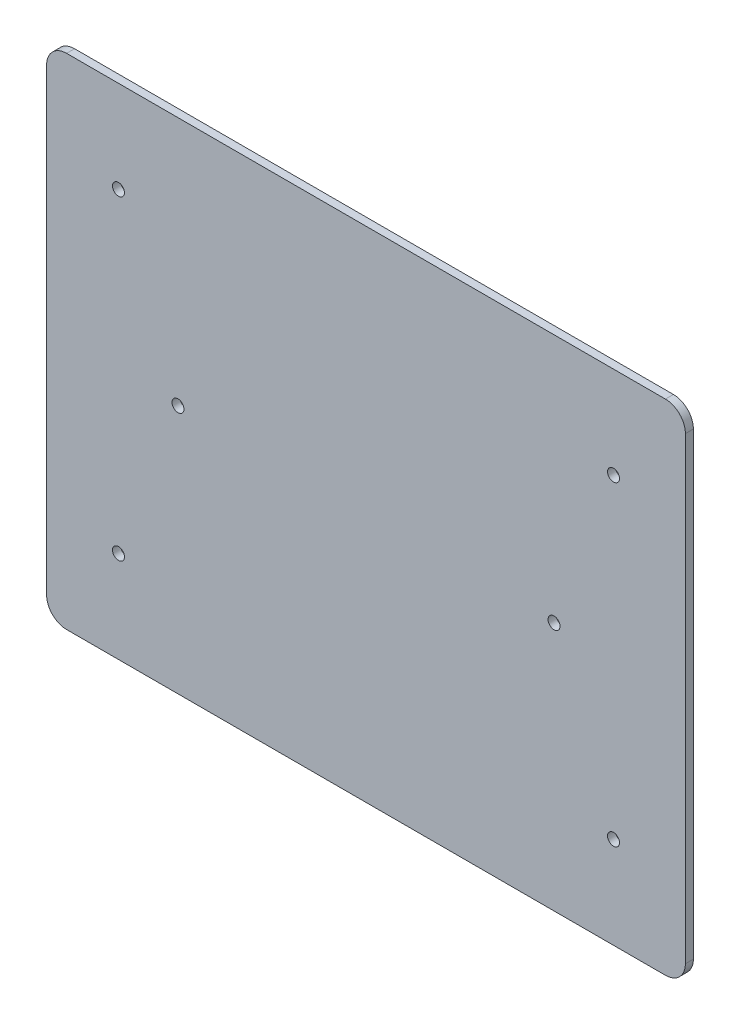
ISO-10303-21;
HEADER;
FILE_DESCRIPTION(('STEP AP214'),'2;1');
FILE_NAME('part.step','',(''),(''),'','','');
FILE_SCHEMA(('AUTOMOTIVE_DESIGN { 1 0 10303 214 1 1 1 1 }'));
ENDSEC;
DATA;
#1=APPLICATION_CONTEXT('core data for automotive mechanical design processes');
#2=APPLICATION_PROTOCOL_DEFINITION('international standard','automotive_design',2000,#1);
#3=PRODUCT_CONTEXT('',#1,'mechanical');
#4=PRODUCT('Part','Part','',(#3));
#5=PRODUCT_RELATED_PRODUCT_CATEGORY('part','',(#4));
#6=PRODUCT_DEFINITION_FORMATION('','',#4);
#7=PRODUCT_DEFINITION_CONTEXT('part definition',#1,'design');
#8=PRODUCT_DEFINITION('design','',#6,#7);
#9=PRODUCT_DEFINITION_SHAPE('','',#8);
#10=(LENGTH_UNIT() NAMED_UNIT(*) SI_UNIT(.MILLI.,.METRE.));
#11=(NAMED_UNIT(*) PLANE_ANGLE_UNIT() SI_UNIT($,.RADIAN.));
#12=(NAMED_UNIT(*) SI_UNIT($,.STERADIAN.) SOLID_ANGLE_UNIT());
#13=UNCERTAINTY_MEASURE_WITH_UNIT(LENGTH_MEASURE(1.E-05),#10,'distance_accuracy_value','');
#14=(GEOMETRIC_REPRESENTATION_CONTEXT(3) GLOBAL_UNCERTAINTY_ASSIGNED_CONTEXT((#13)) GLOBAL_UNIT_ASSIGNED_CONTEXT((#10,
#11,#12)) REPRESENTATION_CONTEXT('',''));
#15=CARTESIAN_POINT('',(0.,0.,0.));
#16=DIRECTION('',(0.,0.,1.));
#17=DIRECTION('',(1.,0.,0.));
#18=AXIS2_PLACEMENT_3D('',#15,#16,#17);
#19=CARTESIAN_POINT('',(-102.632364328177,-143.027068540586,2.));
#20=DIRECTION('',(0.,0.,-1.));
#21=DIRECTION('',(-1.,0.,0.));
#22=AXIS2_PLACEMENT_3D('',#19,#20,#21);
#23=CYLINDRICAL_SURFACE('',#22,5.);
#24=CARTESIAN_POINT('',(-102.632364328177,-143.027068540586,0.));
#25=DIRECTION('',(0.,0.,1.));
#26=DIRECTION('',(-1.,0.,0.));
#27=AXIS2_PLACEMENT_3D('',#24,#25,#26);
#28=CIRCLE('',#27,5.);
#29=CARTESIAN_POINT('',(-107.632364328177,-143.027068540586,0.));
#30=VERTEX_POINT('',#29);
#31=CARTESIAN_POINT('',(-102.632364328177,-148.027068540586,0.));
#32=VERTEX_POINT('',#31);
#33=EDGE_CURVE('E129',#30,#32,#28,.T.);
#34=ORIENTED_EDGE('',*,*,#33,.T.);
#35=DIRECTION('',(0.,0.,-1.));
#36=VECTOR('',#35,1.);
#37=CARTESIAN_POINT('',(-102.632364328177,-148.027068540586,2.));
#38=LINE('',#37,#36);
#39=CARTESIAN_POINT('',(-102.632364328177,-148.027068540586,2.));
#40=VERTEX_POINT('',#39);
#41=EDGE_CURVE('E11',#40,#32,#38,.T.);
#42=ORIENTED_EDGE('',*,*,#41,.F.);
#43=CARTESIAN_POINT('',(-102.632364328177,-143.027068540586,2.));
#44=DIRECTION('',(0.,0.,1.));
#45=DIRECTION('',(-1.,0.,0.));
#46=AXIS2_PLACEMENT_3D('',#43,#44,#45);
#47=CIRCLE('',#46,5.);
#48=CARTESIAN_POINT('',(-107.632364328177,-143.027068540586,2.));
#49=VERTEX_POINT('',#48);
#50=EDGE_CURVE('E144',#49,#40,#47,.T.);
#51=ORIENTED_EDGE('',*,*,#50,.F.);
#52=DIRECTION('',(0.,0.,-1.));
#53=VECTOR('',#52,1.);
#54=CARTESIAN_POINT('',(-107.632364328177,-143.027068540586,2.));
#55=LINE('',#54,#53);
#56=EDGE_CURVE('E125',#49,#30,#55,.T.);
#57=ORIENTED_EDGE('',*,*,#56,.T.);
#58=EDGE_LOOP('',(#34,#42,#51,#57));
#59=FACE_BOUND('',#58,.T.);
#60=ADVANCED_FACE('F33',(#59),#23,.T.);
#61=CARTESIAN_POINT('',(47.367635671823,-148.027068540586,2.));
#62=DIRECTION('',(0.,1.,0.));
#63=DIRECTION('',(0.,0.,1.));
#64=AXIS2_PLACEMENT_3D('',#61,#62,#63);
#65=PLANE('',#64);
#66=DIRECTION('',(1.,0.,0.));
#67=VECTOR('',#66,1.);
#68=CARTESIAN_POINT('',(47.367635671823,-148.027068540586,0.));
#69=LINE('',#68,#67);
#70=CARTESIAN_POINT('',(47.367635671823,-148.027068540586,0.));
#71=VERTEX_POINT('',#70);
#72=EDGE_CURVE('E132',#32,#71,#69,.T.);
#73=ORIENTED_EDGE('',*,*,#72,.T.);
#74=DIRECTION('',(0.,0.,-1.));
#75=VECTOR('',#74,1.);
#76=CARTESIAN_POINT('',(47.367635671823,-148.027068540586,2.));
#77=LINE('',#76,#75);
#78=CARTESIAN_POINT('',(47.367635671823,-148.027068540586,2.));
#79=VERTEX_POINT('',#78);
#80=EDGE_CURVE('E41',#79,#71,#77,.T.);
#81=ORIENTED_EDGE('',*,*,#80,.F.);
#82=DIRECTION('',(1.,0.,0.));
#83=VECTOR('',#82,1.);
#84=CARTESIAN_POINT('',(47.367635671823,-148.027068540586,2.));
#85=LINE('',#84,#83);
#86=EDGE_CURVE('E92',#40,#79,#85,.T.);
#87=ORIENTED_EDGE('',*,*,#86,.F.);
#88=ORIENTED_EDGE('',*,*,#41,.T.);
#89=EDGE_LOOP('',(#73,#81,#87,#88));
#90=FACE_BOUND('',#89,.T.);
#91=ADVANCED_FACE('F246',(#90),#65,.F.);
#92=CARTESIAN_POINT('',(47.3676356718231,-143.027068540586,2.));
#93=DIRECTION('',(0.,0.,-1.));
#94=DIRECTION('',(-1.,0.,0.));
#95=AXIS2_PLACEMENT_3D('',#92,#93,#94);
#96=CYLINDRICAL_SURFACE('',#95,5.);
#97=CARTESIAN_POINT('',(47.3676356718231,-143.027068540586,0.));
#98=DIRECTION('',(0.,0.,1.));
#99=DIRECTION('',(1.,0.,0.));
#100=AXIS2_PLACEMENT_3D('',#97,#98,#99);
#101=CIRCLE('',#100,5.);
#102=CARTESIAN_POINT('',(52.3676356718231,-143.027068540586,0.));
#103=VERTEX_POINT('',#102);
#104=EDGE_CURVE('E135',#71,#103,#101,.T.);
#105=ORIENTED_EDGE('',*,*,#104,.T.);
#106=DIRECTION('',(0.,0.,-1.));
#107=VECTOR('',#106,1.);
#108=CARTESIAN_POINT('',(52.3676356718231,-143.027068540586,2.));
#109=LINE('',#108,#107);
#110=CARTESIAN_POINT('',(52.3676356718231,-143.027068540586,2.));
#111=VERTEX_POINT('',#110);
#112=EDGE_CURVE('E151',#111,#103,#109,.T.);
#113=ORIENTED_EDGE('',*,*,#112,.F.);
#114=CARTESIAN_POINT('',(47.3676356718231,-143.027068540586,2.));
#115=DIRECTION('',(0.,0.,1.));
#116=DIRECTION('',(1.,0.,0.));
#117=AXIS2_PLACEMENT_3D('',#114,#115,#116);
#118=CIRCLE('',#117,5.);
#119=EDGE_CURVE('E159',#79,#111,#118,.T.);
#120=ORIENTED_EDGE('',*,*,#119,.F.);
#121=ORIENTED_EDGE('',*,*,#80,.T.);
#122=EDGE_LOOP('',(#105,#113,#120,#121));
#123=FACE_BOUND('',#122,.T.);
#124=ADVANCED_FACE('F157',(#123),#96,.T.);
#125=CARTESIAN_POINT('',(52.3676356718231,-143.027068540586,2.));
#126=DIRECTION('',(-1.,0.,0.));
#127=DIRECTION('',(0.,-1.,0.));
#128=AXIS2_PLACEMENT_3D('',#125,#126,#127);
#129=PLANE('',#128);
#130=DIRECTION('',(0.,1.,0.));
#131=VECTOR('',#130,1.);
#132=CARTESIAN_POINT('',(52.3676356718231,-143.027068540586,0.));
#133=LINE('',#132,#131);
#134=CARTESIAN_POINT('',(52.3676356718231,-28.0270685405863,0.));
#135=VERTEX_POINT('',#134);
#136=EDGE_CURVE('E137',#103,#135,#133,.T.);
#137=ORIENTED_EDGE('',*,*,#136,.T.);
#138=DIRECTION('',(0.,0.,-1.));
#139=VECTOR('',#138,1.);
#140=CARTESIAN_POINT('',(52.3676356718231,-28.0270685405863,2.));
#141=LINE('',#140,#139);
#142=CARTESIAN_POINT('',(52.3676356718231,-28.0270685405863,2.));
#143=VERTEX_POINT('',#142);
#144=EDGE_CURVE('E148',#143,#135,#141,.T.);
#145=ORIENTED_EDGE('',*,*,#144,.F.);
#146=DIRECTION('',(0.,1.,0.));
#147=VECTOR('',#146,1.);
#148=CARTESIAN_POINT('',(52.3676356718231,-143.027068540586,2.));
#149=LINE('',#148,#147);
#150=EDGE_CURVE('E171',#111,#143,#149,.T.);
#151=ORIENTED_EDGE('',*,*,#150,.F.);
#152=ORIENTED_EDGE('',*,*,#112,.T.);
#153=EDGE_LOOP('',(#137,#145,#151,#152));
#154=FACE_BOUND('',#153,.T.);
#155=ADVANCED_FACE('F167',(#154),#129,.F.);
#156=CARTESIAN_POINT('',(47.3676356718231,-28.0270685405863,2.));
#157=DIRECTION('',(0.,0.,-1.));
#158=DIRECTION('',(-1.,0.,0.));
#159=AXIS2_PLACEMENT_3D('',#156,#157,#158);
#160=CYLINDRICAL_SURFACE('',#159,5.);
#161=CARTESIAN_POINT('',(47.3676356718231,-28.0270685405863,0.));
#162=DIRECTION('',(0.,0.,1.));
#163=DIRECTION('',(1.,0.,0.));
#164=AXIS2_PLACEMENT_3D('',#161,#162,#163);
#165=CIRCLE('',#164,5.);
#166=CARTESIAN_POINT('',(47.3676356718231,-23.0270685405863,0.));
#167=VERTEX_POINT('',#166);
#168=EDGE_CURVE('E139',#135,#167,#165,.T.);
#169=ORIENTED_EDGE('',*,*,#168,.T.);
#170=DIRECTION('',(0.,0.,-1.));
#171=VECTOR('',#170,1.);
#172=CARTESIAN_POINT('',(47.3676356718231,-23.0270685405863,2.));
#173=LINE('',#172,#171);
#174=CARTESIAN_POINT('',(47.3676356718231,-23.0270685405863,2.));
#175=VERTEX_POINT('',#174);
#176=EDGE_CURVE('E120',#175,#167,#173,.T.);
#177=ORIENTED_EDGE('',*,*,#176,.F.);
#178=CARTESIAN_POINT('',(47.3676356718231,-28.0270685405863,2.));
#179=DIRECTION('',(0.,0.,1.));
#180=DIRECTION('',(1.,0.,0.));
#181=AXIS2_PLACEMENT_3D('',#178,#179,#180);
#182=CIRCLE('',#181,5.);
#183=EDGE_CURVE('E111',#143,#175,#182,.T.);
#184=ORIENTED_EDGE('',*,*,#183,.F.);
#185=ORIENTED_EDGE('',*,*,#144,.T.);
#186=EDGE_LOOP('',(#169,#177,#184,#185));
#187=FACE_BOUND('',#186,.T.);
#188=ADVANCED_FACE('F170',(#187),#160,.T.);
#189=CARTESIAN_POINT('',(47.3676356718231,-23.0270685405863,2.));
#190=DIRECTION('',(0.,-1.,0.));
#191=DIRECTION('',(1.,0.,0.));
#192=AXIS2_PLACEMENT_3D('',#189,#190,#191);
#193=PLANE('',#192);
#194=DIRECTION('',(-1.,0.,0.));
#195=VECTOR('',#194,1.);
#196=CARTESIAN_POINT('',(47.3676356718231,-23.0270685405863,0.));
#197=LINE('',#196,#195);
#198=CARTESIAN_POINT('',(-102.632364328177,-23.0270685405863,0.));
#199=VERTEX_POINT('',#198);
#200=EDGE_CURVE('E119',#167,#199,#197,.T.);
#201=ORIENTED_EDGE('',*,*,#200,.T.);
#202=DIRECTION('',(0.,0.,-1.));
#203=VECTOR('',#202,1.);
#204=CARTESIAN_POINT('',(-102.632364328177,-23.0270685405863,2.));
#205=LINE('',#204,#203);
#206=CARTESIAN_POINT('',(-102.632364328177,-23.0270685405863,2.));
#207=VERTEX_POINT('',#206);
#208=EDGE_CURVE('E116',#207,#199,#205,.T.);
#209=ORIENTED_EDGE('',*,*,#208,.F.);
#210=DIRECTION('',(-1.,0.,0.));
#211=VECTOR('',#210,1.);
#212=CARTESIAN_POINT('',(47.3676356718231,-23.0270685405863,2.));
#213=LINE('',#212,#211);
#214=EDGE_CURVE('E105',#175,#207,#213,.T.);
#215=ORIENTED_EDGE('',*,*,#214,.F.);
#216=ORIENTED_EDGE('',*,*,#176,.T.);
#217=EDGE_LOOP('',(#201,#209,#215,#216));
#218=FACE_BOUND('',#217,.T.);
#219=ADVANCED_FACE('F117',(#218),#193,.F.);
#220=CARTESIAN_POINT('',(-102.632364328177,-28.0270685405863,2.));
#221=DIRECTION('',(0.,0.,-1.));
#222=DIRECTION('',(-1.,0.,0.));
#223=AXIS2_PLACEMENT_3D('',#220,#221,#222);
#224=CYLINDRICAL_SURFACE('',#223,5.);
#225=CARTESIAN_POINT('',(-102.632364328177,-28.0270685405863,0.));
#226=DIRECTION('',(0.,0.,1.));
#227=DIRECTION('',(1.,0.,0.));
#228=AXIS2_PLACEMENT_3D('',#225,#226,#227);
#229=CIRCLE('',#228,5.);
#230=CARTESIAN_POINT('',(-107.632364328177,-28.0270685405863,0.));
#231=VERTEX_POINT('',#230);
#232=EDGE_CURVE('E78',#199,#231,#229,.T.);
#233=ORIENTED_EDGE('',*,*,#232,.T.);
#234=DIRECTION('',(0.,0.,-1.));
#235=VECTOR('',#234,1.);
#236=CARTESIAN_POINT('',(-107.632364328177,-28.0270685405863,2.));
#237=LINE('',#236,#235);
#238=CARTESIAN_POINT('',(-107.632364328177,-28.0270685405863,2.));
#239=VERTEX_POINT('',#238);
#240=EDGE_CURVE('E121',#239,#231,#237,.T.);
#241=ORIENTED_EDGE('',*,*,#240,.F.);
#242=CARTESIAN_POINT('',(-102.632364328177,-28.0270685405863,2.));
#243=DIRECTION('',(0.,0.,1.));
#244=DIRECTION('',(1.,0.,0.));
#245=AXIS2_PLACEMENT_3D('',#242,#243,#244);
#246=CIRCLE('',#245,5.);
#247=EDGE_CURVE('E109',#207,#239,#246,.T.);
#248=ORIENTED_EDGE('',*,*,#247,.F.);
#249=ORIENTED_EDGE('',*,*,#208,.T.);
#250=EDGE_LOOP('',(#233,#241,#248,#249));
#251=FACE_BOUND('',#250,.T.);
#252=ADVANCED_FACE('F123',(#251),#224,.T.);
#253=CARTESIAN_POINT('',(-107.632364328177,-143.027068540586,2.));
#254=DIRECTION('',(1.,0.,0.));
#255=DIRECTION('',(0.,0.,-1.));
#256=AXIS2_PLACEMENT_3D('',#253,#254,#255);
#257=PLANE('',#256);
#258=DIRECTION('',(0.,-1.,0.));
#259=VECTOR('',#258,1.);
#260=CARTESIAN_POINT('',(-107.632364328177,-143.027068540586,0.));
#261=LINE('',#260,#259);
#262=EDGE_CURVE('E84',#231,#30,#261,.T.);
#263=ORIENTED_EDGE('',*,*,#262,.T.);
#264=ORIENTED_EDGE('',*,*,#56,.F.);
#265=DIRECTION('',(0.,-1.,0.));
#266=VECTOR('',#265,1.);
#267=CARTESIAN_POINT('',(-107.632364328177,-143.027068540586,2.));
#268=LINE('',#267,#266);
#269=EDGE_CURVE('E49',#239,#49,#268,.T.);
#270=ORIENTED_EDGE('',*,*,#269,.F.);
#271=ORIENTED_EDGE('',*,*,#240,.T.);
#272=EDGE_LOOP('',(#263,#264,#270,#271));
#273=FACE_BOUND('',#272,.T.);
#274=ADVANCED_FACE('F237',(#273),#257,.F.);
#275=CARTESIAN_POINT('',(-102.632364328177,-143.027068540586,2.));
#276=DIRECTION('',(0.,0.,-1.));
#277=DIRECTION('',(-1.,0.,0.));
#278=AXIS2_PLACEMENT_3D('',#275,#276,#277);
#279=PLANE('',#278);
#280=CARTESIAN_POINT('',(19.4676356718231,-85.5270685405863,2.));
#281=DIRECTION('',(0.,0.,-1.));
#282=DIRECTION('',(-1.,0.,0.));
#283=AXIS2_PLACEMENT_3D('',#280,#281,#282);
#284=CIRCLE('',#283,1.5);
#285=CARTESIAN_POINT('',(17.9676356718231,-85.5270685405863,2.));
#286=VERTEX_POINT('',#285);
#287=EDGE_CURVE('E182',#286,#286,#284,.T.);
#288=ORIENTED_EDGE('',*,*,#287,.T.);
#289=EDGE_LOOP('',(#288));
#290=FACE_BOUND('',#289,.T.);
#291=CARTESIAN_POINT('',(34.3676356718231,-46.0270685405863,2.));
#292=DIRECTION('',(0.,0.,-1.));
#293=DIRECTION('',(-1.,0.,0.));
#294=AXIS2_PLACEMENT_3D('',#291,#292,#293);
#295=CIRCLE('',#294,1.5);
#296=CARTESIAN_POINT('',(32.8676356718231,-46.0270685405863,2.));
#297=VERTEX_POINT('',#296);
#298=EDGE_CURVE('E185',#297,#297,#295,.T.);
#299=ORIENTED_EDGE('',*,*,#298,.T.);
#300=EDGE_LOOP('',(#299));
#301=FACE_BOUND('',#300,.T.);
#302=CARTESIAN_POINT('',(-89.6323643281769,-46.0270685405863,2.));
#303=DIRECTION('',(0.,0.,-1.));
#304=DIRECTION('',(-1.,0.,0.));
#305=AXIS2_PLACEMENT_3D('',#302,#303,#304);
#306=CIRCLE('',#305,1.50000000000003);
#307=CARTESIAN_POINT('',(-91.1323643281769,-46.0270685405863,2.));
#308=VERTEX_POINT('',#307);
#309=EDGE_CURVE('E188',#308,#308,#306,.T.);
#310=ORIENTED_EDGE('',*,*,#309,.T.);
#311=EDGE_LOOP('',(#310));
#312=FACE_BOUND('',#311,.T.);
#313=CARTESIAN_POINT('',(-74.7323643281769,-85.5270685405863,2.));
#314=DIRECTION('',(0.,0.,-1.));
#315=DIRECTION('',(-1.,0.,0.));
#316=AXIS2_PLACEMENT_3D('',#313,#314,#315);
#317=CIRCLE('',#316,1.5);
#318=CARTESIAN_POINT('',(-76.2323643281769,-85.5270685405863,2.));
#319=VERTEX_POINT('',#318);
#320=EDGE_CURVE('E191',#319,#319,#317,.T.);
#321=ORIENTED_EDGE('',*,*,#320,.T.);
#322=EDGE_LOOP('',(#321));
#323=FACE_BOUND('',#322,.T.);
#324=CARTESIAN_POINT('',(-89.6323643281769,-125.027068540586,2.));
#325=DIRECTION('',(0.,0.,-1.));
#326=DIRECTION('',(-1.,0.,0.));
#327=AXIS2_PLACEMENT_3D('',#324,#325,#326);
#328=CIRCLE('',#327,1.50000000000003);
#329=CARTESIAN_POINT('',(-91.1323643281769,-125.027068540586,2.));
#330=VERTEX_POINT('',#329);
#331=EDGE_CURVE('E194',#330,#330,#328,.T.);
#332=ORIENTED_EDGE('',*,*,#331,.T.);
#333=EDGE_LOOP('',(#332));
#334=FACE_BOUND('',#333,.T.);
#335=CARTESIAN_POINT('',(34.3676356718231,-125.027068540586,2.));
#336=DIRECTION('',(0.,0.,-1.));
#337=DIRECTION('',(-1.,0.,0.));
#338=AXIS2_PLACEMENT_3D('',#335,#336,#337);
#339=CIRCLE('',#338,1.5);
#340=CARTESIAN_POINT('',(32.8676356718231,-125.027068540586,2.));
#341=VERTEX_POINT('',#340);
#342=EDGE_CURVE('E133',#341,#341,#339,.T.);
#343=ORIENTED_EDGE('',*,*,#342,.T.);
#344=EDGE_LOOP('',(#343));
#345=FACE_BOUND('',#344,.T.);
#346=ORIENTED_EDGE('',*,*,#50,.T.);
#347=ORIENTED_EDGE('',*,*,#86,.T.);
#348=ORIENTED_EDGE('',*,*,#119,.T.);
#349=ORIENTED_EDGE('',*,*,#150,.T.);
#350=ORIENTED_EDGE('',*,*,#183,.T.);
#351=ORIENTED_EDGE('',*,*,#214,.T.);
#352=ORIENTED_EDGE('',*,*,#247,.T.);
#353=ORIENTED_EDGE('',*,*,#269,.T.);
#354=EDGE_LOOP('',(#346,#347,#348,#349,#350,#351,#352,#353));
#355=FACE_BOUND('',#354,.T.);
#356=ADVANCED_FACE('F107',(#290,#301,#312,#323,#334,#345,#355),#279,.F.);
#357=CARTESIAN_POINT('',(-102.632364328177,-143.027068540586,0.));
#358=DIRECTION('',(0.,0.,-1.));
#359=DIRECTION('',(-1.,0.,0.));
#360=AXIS2_PLACEMENT_3D('',#357,#358,#359);
#361=PLANE('',#360);
#362=CARTESIAN_POINT('',(19.4676356718231,-85.5270685405863,0.));
#363=DIRECTION('',(0.,0.,-1.));
#364=DIRECTION('',(-1.,0.,0.));
#365=AXIS2_PLACEMENT_3D('',#362,#363,#364);
#366=CIRCLE('',#365,1.5);
#367=CARTESIAN_POINT('',(17.9676356718231,-85.5270685405863,0.));
#368=VERTEX_POINT('',#367);
#369=EDGE_CURVE('E197',#368,#368,#366,.T.);
#370=ORIENTED_EDGE('',*,*,#369,.F.);
#371=EDGE_LOOP('',(#370));
#372=FACE_BOUND('',#371,.T.);
#373=CARTESIAN_POINT('',(34.3676356718231,-46.0270685405863,0.));
#374=DIRECTION('',(0.,0.,-1.));
#375=DIRECTION('',(-1.,0.,0.));
#376=AXIS2_PLACEMENT_3D('',#373,#374,#375);
#377=CIRCLE('',#376,1.5);
#378=CARTESIAN_POINT('',(32.8676356718231,-46.0270685405863,0.));
#379=VERTEX_POINT('',#378);
#380=EDGE_CURVE('E207',#379,#379,#377,.T.);
#381=ORIENTED_EDGE('',*,*,#380,.F.);
#382=EDGE_LOOP('',(#381));
#383=FACE_BOUND('',#382,.T.);
#384=CARTESIAN_POINT('',(-89.6323643281769,-46.0270685405863,0.));
#385=DIRECTION('',(0.,0.,-1.));
#386=DIRECTION('',(1.,0.,0.));
#387=AXIS2_PLACEMENT_3D('',#384,#385,#386);
#388=CIRCLE('',#387,1.50000000000003);
#389=CARTESIAN_POINT('',(-88.1323643281769,-46.0270685405863,0.));
#390=VERTEX_POINT('',#389);
#391=EDGE_CURVE('E204',#390,#390,#388,.T.);
#392=ORIENTED_EDGE('',*,*,#391,.F.);
#393=EDGE_LOOP('',(#392));
#394=FACE_BOUND('',#393,.T.);
#395=CARTESIAN_POINT('',(-74.7323643281769,-85.5270685405863,0.));
#396=DIRECTION('',(0.,0.,-1.));
#397=DIRECTION('',(1.,0.,0.));
#398=AXIS2_PLACEMENT_3D('',#395,#396,#397);
#399=CIRCLE('',#398,1.5);
#400=CARTESIAN_POINT('',(-73.2323643281769,-85.5270685405863,0.));
#401=VERTEX_POINT('',#400);
#402=EDGE_CURVE('E201',#401,#401,#399,.T.);
#403=ORIENTED_EDGE('',*,*,#402,.F.);
#404=EDGE_LOOP('',(#403));
#405=FACE_BOUND('',#404,.T.);
#406=CARTESIAN_POINT('',(-89.6323643281769,-125.027068540586,0.));
#407=DIRECTION('',(0.,0.,-1.));
#408=DIRECTION('',(1.,0.,0.));
#409=AXIS2_PLACEMENT_3D('',#406,#407,#408);
#410=CIRCLE('',#409,1.50000000000003);
#411=CARTESIAN_POINT('',(-88.1323643281769,-125.027068540586,0.));
#412=VERTEX_POINT('',#411);
#413=EDGE_CURVE('E198',#412,#412,#410,.T.);
#414=ORIENTED_EDGE('',*,*,#413,.F.);
#415=EDGE_LOOP('',(#414));
#416=FACE_BOUND('',#415,.T.);
#417=CARTESIAN_POINT('',(34.3676356718231,-125.027068540586,0.));
#418=DIRECTION('',(0.,0.,-1.));
#419=DIRECTION('',(-1.,0.,0.));
#420=AXIS2_PLACEMENT_3D('',#417,#418,#419);
#421=CIRCLE('',#420,1.5);
#422=CARTESIAN_POINT('',(32.8676356718231,-125.027068540586,0.));
#423=VERTEX_POINT('',#422);
#424=EDGE_CURVE('E179',#423,#423,#421,.T.);
#425=ORIENTED_EDGE('',*,*,#424,.F.);
#426=EDGE_LOOP('',(#425));
#427=FACE_BOUND('',#426,.T.);
#428=ORIENTED_EDGE('',*,*,#33,.F.);
#429=ORIENTED_EDGE('',*,*,#262,.F.);
#430=ORIENTED_EDGE('',*,*,#232,.F.);
#431=ORIENTED_EDGE('',*,*,#200,.F.);
#432=ORIENTED_EDGE('',*,*,#168,.F.);
#433=ORIENTED_EDGE('',*,*,#136,.F.);
#434=ORIENTED_EDGE('',*,*,#104,.F.);
#435=ORIENTED_EDGE('',*,*,#72,.F.);
#436=EDGE_LOOP('',(#428,#429,#430,#431,#432,#433,#434,#435));
#437=FACE_BOUND('',#436,.T.);
#438=ADVANCED_FACE('F163',(#372,#383,#394,#405,#416,#427,#437),#361,.T.);
#439=CARTESIAN_POINT('',(34.3676356718231,-125.027068540586,10.));
#440=DIRECTION('',(0.,0.,-1.));
#441=DIRECTION('',(-1.,0.,0.));
#442=AXIS2_PLACEMENT_3D('',#439,#440,#441);
#443=CYLINDRICAL_SURFACE('',#442,1.5);
#444=ORIENTED_EDGE('',*,*,#424,.T.);
#445=EDGE_LOOP('',(#444));
#446=FACE_BOUND('',#445,.T.);
#447=ORIENTED_EDGE('',*,*,#342,.F.);
#448=EDGE_LOOP('',(#447));
#449=FACE_BOUND('',#448,.T.);
#450=ADVANCED_FACE('F218',(#446,#449),#443,.F.);
#451=CARTESIAN_POINT('',(-89.6323643281769,-125.027068540586,10.));
#452=DIRECTION('',(0.,0.,-1.));
#453=DIRECTION('',(-1.,0.,0.));
#454=AXIS2_PLACEMENT_3D('',#451,#452,#453);
#455=CYLINDRICAL_SURFACE('',#454,1.50000000000003);
#456=ORIENTED_EDGE('',*,*,#413,.T.);
#457=EDGE_LOOP('',(#456));
#458=FACE_BOUND('',#457,.T.);
#459=ORIENTED_EDGE('',*,*,#331,.F.);
#460=EDGE_LOOP('',(#459));
#461=FACE_BOUND('',#460,.T.);
#462=ADVANCED_FACE('F232',(#458,#461),#455,.F.);
#463=CARTESIAN_POINT('',(-74.7323643281769,-85.5270685405863,10.));
#464=DIRECTION('',(0.,0.,-1.));
#465=DIRECTION('',(-1.,0.,0.));
#466=AXIS2_PLACEMENT_3D('',#463,#464,#465);
#467=CYLINDRICAL_SURFACE('',#466,1.5);
#468=ORIENTED_EDGE('',*,*,#402,.T.);
#469=EDGE_LOOP('',(#468));
#470=FACE_BOUND('',#469,.T.);
#471=ORIENTED_EDGE('',*,*,#320,.F.);
#472=EDGE_LOOP('',(#471));
#473=FACE_BOUND('',#472,.T.);
#474=ADVANCED_FACE('F298',(#470,#473),#467,.F.);
#475=CARTESIAN_POINT('',(-89.6323643281769,-46.0270685405863,10.));
#476=DIRECTION('',(0.,0.,-1.));
#477=DIRECTION('',(-1.,0.,0.));
#478=AXIS2_PLACEMENT_3D('',#475,#476,#477);
#479=CYLINDRICAL_SURFACE('',#478,1.50000000000003);
#480=ORIENTED_EDGE('',*,*,#391,.T.);
#481=EDGE_LOOP('',(#480));
#482=FACE_BOUND('',#481,.T.);
#483=ORIENTED_EDGE('',*,*,#309,.F.);
#484=EDGE_LOOP('',(#483));
#485=FACE_BOUND('',#484,.T.);
#486=ADVANCED_FACE('F308',(#482,#485),#479,.F.);
#487=CARTESIAN_POINT('',(34.3676356718231,-46.0270685405863,10.));
#488=DIRECTION('',(0.,0.,-1.));
#489=DIRECTION('',(-1.,0.,0.));
#490=AXIS2_PLACEMENT_3D('',#487,#488,#489);
#491=CYLINDRICAL_SURFACE('',#490,1.5);
#492=ORIENTED_EDGE('',*,*,#380,.T.);
#493=EDGE_LOOP('',(#492));
#494=FACE_BOUND('',#493,.T.);
#495=ORIENTED_EDGE('',*,*,#298,.F.);
#496=EDGE_LOOP('',(#495));
#497=FACE_BOUND('',#496,.T.);
#498=ADVANCED_FACE('F318',(#494,#497),#491,.F.);
#499=CARTESIAN_POINT('',(19.4676356718231,-85.5270685405863,10.));
#500=DIRECTION('',(0.,0.,-1.));
#501=DIRECTION('',(-1.,0.,0.));
#502=AXIS2_PLACEMENT_3D('',#499,#500,#501);
#503=CYLINDRICAL_SURFACE('',#502,1.5);
#504=ORIENTED_EDGE('',*,*,#369,.T.);
#505=EDGE_LOOP('',(#504));
#506=FACE_BOUND('',#505,.T.);
#507=ORIENTED_EDGE('',*,*,#287,.F.);
#508=EDGE_LOOP('',(#507));
#509=FACE_BOUND('',#508,.T.);
#510=ADVANCED_FACE('F213',(#506,#509),#503,.F.);
#511=CLOSED_SHELL('',(#60,#91,#124,#155,#188,#219,#252,#274,#356,#438,#450,#462,#474,#486,#498,#510));
#512=MANIFOLD_SOLID_BREP('B2',#511);
#513=ADVANCED_BREP_SHAPE_REPRESENTATION('',(#18,#512),#14);
#514=SHAPE_DEFINITION_REPRESENTATION(#9,#513);
ENDSEC;
END-ISO-10303-21;
